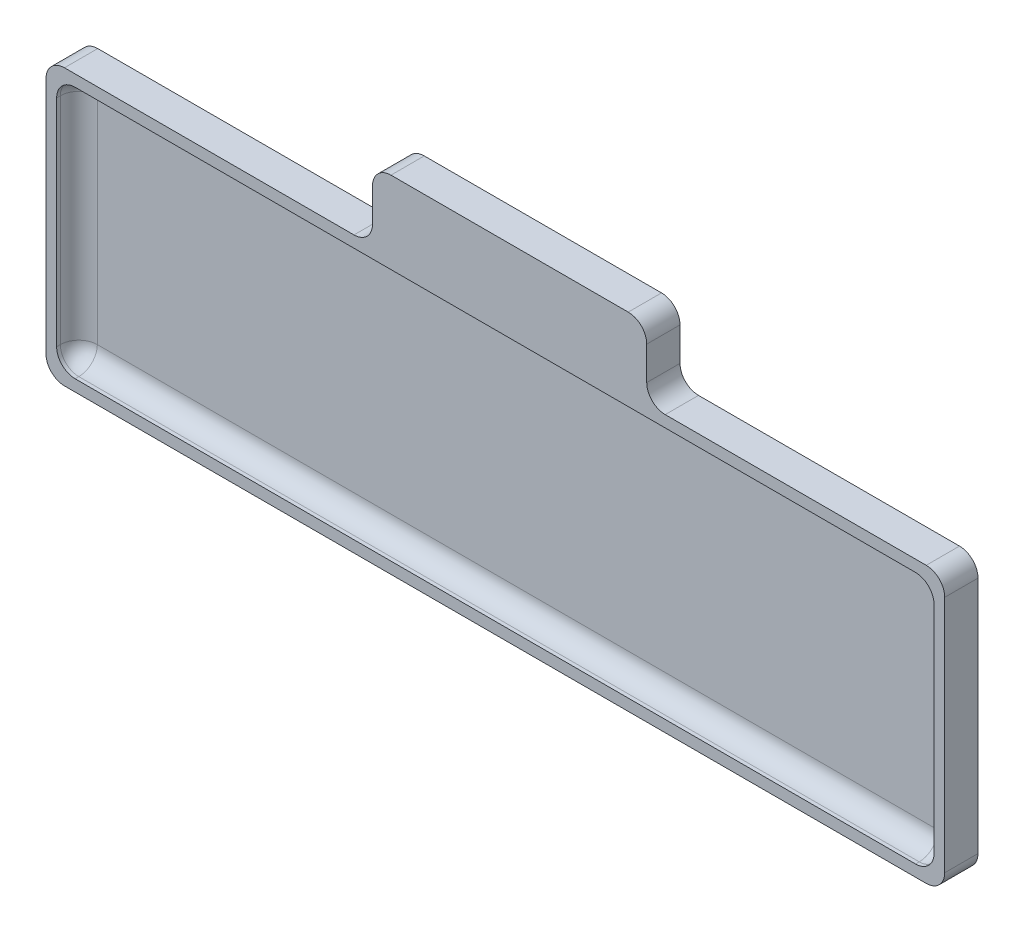
ISO-10303-21;
HEADER;
FILE_DESCRIPTION(('STEP AP214'),'2;1');
FILE_NAME('part.step','',(''),(''),'','','');
FILE_SCHEMA(('AUTOMOTIVE_DESIGN { 1 0 10303 214 1 1 1 1 }'));
ENDSEC;
DATA;
#1=APPLICATION_CONTEXT('core data for automotive mechanical design processes');
#2=APPLICATION_PROTOCOL_DEFINITION('international standard','automotive_design',2000,#1);
#3=PRODUCT_CONTEXT('',#1,'mechanical');
#4=PRODUCT('Part','Part','',(#3));
#5=PRODUCT_RELATED_PRODUCT_CATEGORY('part','',(#4));
#6=PRODUCT_DEFINITION_FORMATION('','',#4);
#7=PRODUCT_DEFINITION_CONTEXT('part definition',#1,'design');
#8=PRODUCT_DEFINITION('design','',#6,#7);
#9=PRODUCT_DEFINITION_SHAPE('','',#8);
#10=(LENGTH_UNIT() NAMED_UNIT(*) SI_UNIT(.MILLI.,.METRE.));
#11=(NAMED_UNIT(*) PLANE_ANGLE_UNIT() SI_UNIT($,.RADIAN.));
#12=(NAMED_UNIT(*) SI_UNIT($,.STERADIAN.) SOLID_ANGLE_UNIT());
#13=UNCERTAINTY_MEASURE_WITH_UNIT(LENGTH_MEASURE(1.E-05),#10,'distance_accuracy_value','');
#14=(GEOMETRIC_REPRESENTATION_CONTEXT(3) GLOBAL_UNCERTAINTY_ASSIGNED_CONTEXT((#13)) GLOBAL_UNIT_ASSIGNED_CONTEXT((#10,
#11,#12)) REPRESENTATION_CONTEXT('',''));
#15=CARTESIAN_POINT('',(0.,0.,0.));
#16=DIRECTION('',(0.,0.,1.));
#17=DIRECTION('',(1.,0.,0.));
#18=AXIS2_PLACEMENT_3D('',#15,#16,#17);
#19=CARTESIAN_POINT('',(0.,85.9423728813559,3.));
#20=DIRECTION('',(0.,1.,0.));
#21=DIRECTION('',(0.,0.,1.));
#22=AXIS2_PLACEMENT_3D('',#19,#20,#21);
#23=PLANE('',#22);
#24=DIRECTION('',(1.,0.,0.));
#25=VECTOR('',#24,1.);
#26=CARTESIAN_POINT('',(0.,85.9423728813559,9.));
#27=LINE('',#26,#25);
#28=CARTESIAN_POINT('',(-112.793220338983,85.9423728813559,9.));
#29=VERTEX_POINT('',#28);
#30=CARTESIAN_POINT('',(-34.5155586647697,85.9423728813559,9.));
#31=VERTEX_POINT('',#30);
#32=EDGE_CURVE('E412',#29,#31,#27,.T.);
#33=ORIENTED_EDGE('',*,*,#32,.T.);
#34=DIRECTION('',(0.,0.,1.));
#35=VECTOR('',#34,1.);
#36=CARTESIAN_POINT('',(-34.5155586647697,85.9423728813559,3.));
#37=LINE('',#36,#35);
#38=CARTESIAN_POINT('',(-34.5155586647697,85.9423728813559,0.));
#39=VERTEX_POINT('',#38);
#40=EDGE_CURVE('E300',#31,#39,#37,.F.);
#41=ORIENTED_EDGE('',*,*,#40,.T.);
#42=DIRECTION('',(1.,0.,0.));
#43=VECTOR('',#42,1.);
#44=CARTESIAN_POINT('',(0.,85.9423728813559,0.));
#45=LINE('',#44,#43);
#46=CARTESIAN_POINT('',(-112.793220338983,85.9423728813559,0.));
#47=VERTEX_POINT('',#46);
#48=EDGE_CURVE('E423',#47,#39,#45,.T.);
#49=ORIENTED_EDGE('',*,*,#48,.F.);
#50=DIRECTION('',(0.,0.,-1.));
#51=VECTOR('',#50,1.);
#52=CARTESIAN_POINT('',(-112.793220338983,85.9423728813559,9.));
#53=LINE('',#52,#51);
#54=EDGE_CURVE('E298',#47,#29,#53,.F.);
#55=ORIENTED_EDGE('',*,*,#54,.T.);
#56=EDGE_LOOP('',(#33,#41,#49,#55));
#57=FACE_BOUND('',#56,.T.);
#58=ADVANCED_FACE('F39',(#57),#23,.T.);
#59=CARTESIAN_POINT('',(125.206779661017,0.,3.));
#60=DIRECTION('',(1.,0.,0.));
#61=DIRECTION('',(0.,0.,-1.));
#62=AXIS2_PLACEMENT_3D('',#59,#60,#61);
#63=PLANE('',#62);
#64=DIRECTION('',(0.,-1.,0.));
#65=VECTOR('',#64,1.);
#66=CARTESIAN_POINT('',(125.206779661017,0.,0.));
#67=LINE('',#66,#65);
#68=CARTESIAN_POINT('',(125.206779661017,80.9423728813559,0.));
#69=VERTEX_POINT('',#68);
#70=CARTESIAN_POINT('',(125.206779661017,16.4423728813559,0.));
#71=VERTEX_POINT('',#70);
#72=EDGE_CURVE('E419',#69,#71,#67,.T.);
#73=ORIENTED_EDGE('',*,*,#72,.F.);
#74=DIRECTION('',(0.,0.,-1.));
#75=VECTOR('',#74,1.);
#76=CARTESIAN_POINT('',(125.206779661017,80.9423728813559,3.));
#77=LINE('',#76,#75);
#78=CARTESIAN_POINT('',(125.206779661017,80.9423728813559,9.));
#79=VERTEX_POINT('',#78);
#80=EDGE_CURVE('E333',#69,#79,#77,.F.);
#81=ORIENTED_EDGE('',*,*,#80,.T.);
#82=DIRECTION('',(0.,-1.,0.));
#83=VECTOR('',#82,1.);
#84=CARTESIAN_POINT('',(125.206779661017,0.,9.));
#85=LINE('',#84,#83);
#86=CARTESIAN_POINT('',(125.206779661017,16.4423728813559,9.));
#87=VERTEX_POINT('',#86);
#88=EDGE_CURVE('E442',#79,#87,#85,.T.);
#89=ORIENTED_EDGE('',*,*,#88,.T.);
#90=DIRECTION('',(0.,0.,-1.));
#91=VECTOR('',#90,1.);
#92=CARTESIAN_POINT('',(125.206779661017,16.4423728813559,0.));
#93=LINE('',#92,#91);
#94=EDGE_CURVE('E330',#87,#71,#93,.T.);
#95=ORIENTED_EDGE('',*,*,#94,.T.);
#96=EDGE_LOOP('',(#73,#81,#89,#95));
#97=FACE_BOUND('',#96,.T.);
#98=ADVANCED_FACE('F473',(#97),#63,.T.);
#99=CARTESIAN_POINT('',(49.6346793475373,85.9423728813559,0.));
#100=VERTEX_POINT('',#99);
#101=CARTESIAN_POINT('',(120.206779661017,85.9423728813559,0.));
#102=VERTEX_POINT('',#101);
#103=EDGE_CURVE('E422',#100,#102,#45,.T.);
#104=ORIENTED_EDGE('',*,*,#103,.F.);
#105=DIRECTION('',(0.,0.,-1.));
#106=VECTOR('',#105,1.);
#107=CARTESIAN_POINT('',(49.6346793475373,85.9423728813559,3.));
#108=LINE('',#107,#106);
#109=CARTESIAN_POINT('',(49.6346793475373,85.9423728813559,9.));
#110=VERTEX_POINT('',#109);
#111=EDGE_CURVE('E291',#100,#110,#108,.F.);
#112=ORIENTED_EDGE('',*,*,#111,.T.);
#113=CARTESIAN_POINT('',(120.206779661017,85.9423728813559,9.));
#114=VERTEX_POINT('',#113);
#115=EDGE_CURVE('E446',#110,#114,#27,.T.);
#116=ORIENTED_EDGE('',*,*,#115,.T.);
#117=DIRECTION('',(0.,0.,-1.));
#118=VECTOR('',#117,1.);
#119=CARTESIAN_POINT('',(120.206779661017,85.9423728813559,3.));
#120=LINE('',#119,#118);
#121=EDGE_CURVE('E288',#114,#102,#120,.T.);
#122=ORIENTED_EDGE('',*,*,#121,.T.);
#123=EDGE_LOOP('',(#104,#112,#116,#122));
#124=FACE_BOUND('',#123,.T.);
#125=ADVANCED_FACE('F461',(#124),#23,.T.);
#126=CARTESIAN_POINT('',(-117.793220338983,0.,3.));
#127=DIRECTION('',(1.,0.,0.));
#128=DIRECTION('',(0.,1.,0.));
#129=AXIS2_PLACEMENT_3D('',#126,#127,#128);
#130=PLANE('',#129);
#131=DIRECTION('',(0.,-1.,0.));
#132=VECTOR('',#131,1.);
#133=CARTESIAN_POINT('',(-117.793220338983,0.,0.));
#134=LINE('',#133,#132);
#135=CARTESIAN_POINT('',(-117.793220338983,80.9423728813559,0.));
#136=VERTEX_POINT('',#135);
#137=CARTESIAN_POINT('',(-117.793220338983,16.4423728813559,0.));
#138=VERTEX_POINT('',#137);
#139=EDGE_CURVE('E252',#136,#138,#134,.T.);
#140=ORIENTED_EDGE('',*,*,#139,.T.);
#141=DIRECTION('',(0.,0.,-1.));
#142=VECTOR('',#141,1.);
#143=CARTESIAN_POINT('',(-117.793220338983,16.4423728813559,3.));
#144=LINE('',#143,#142);
#145=CARTESIAN_POINT('',(-117.793220338983,16.4423728813559,9.));
#146=VERTEX_POINT('',#145);
#147=EDGE_CURVE('E342',#138,#146,#144,.F.);
#148=ORIENTED_EDGE('',*,*,#147,.T.);
#149=DIRECTION('',(0.,-1.,0.));
#150=VECTOR('',#149,1.);
#151=CARTESIAN_POINT('',(-117.793220338983,0.,9.));
#152=LINE('',#151,#150);
#153=CARTESIAN_POINT('',(-117.793220338983,80.9423728813559,9.));
#154=VERTEX_POINT('',#153);
#155=EDGE_CURVE('E406',#154,#146,#152,.T.);
#156=ORIENTED_EDGE('',*,*,#155,.F.);
#157=DIRECTION('',(0.,0.,-1.));
#158=VECTOR('',#157,1.);
#159=CARTESIAN_POINT('',(-117.793220338983,80.9423728813559,0.));
#160=LINE('',#159,#158);
#161=EDGE_CURVE('E340',#154,#136,#160,.T.);
#162=ORIENTED_EDGE('',*,*,#161,.T.);
#163=EDGE_LOOP('',(#140,#148,#156,#162));
#164=FACE_BOUND('',#163,.T.);
#165=ADVANCED_FACE('F427',(#164),#130,.F.);
#166=CARTESIAN_POINT('',(0.,11.4423728813559,3.));
#167=DIRECTION('',(0.,1.,0.));
#168=DIRECTION('',(0.,0.,1.));
#169=AXIS2_PLACEMENT_3D('',#166,#167,#168);
#170=PLANE('',#169);
#171=DIRECTION('',(1.,0.,0.));
#172=VECTOR('',#171,1.);
#173=CARTESIAN_POINT('',(0.,11.4423728813559,0.));
#174=LINE('',#173,#172);
#175=CARTESIAN_POINT('',(-112.793220338983,11.4423728813559,0.));
#176=VERTEX_POINT('',#175);
#177=CARTESIAN_POINT('',(120.206779661017,11.4423728813559,0.));
#178=VERTEX_POINT('',#177);
#179=EDGE_CURVE('E249',#176,#178,#174,.T.);
#180=ORIENTED_EDGE('',*,*,#179,.T.);
#181=DIRECTION('',(0.,0.,-1.));
#182=VECTOR('',#181,1.);
#183=CARTESIAN_POINT('',(120.206779661017,11.4423728813559,9.));
#184=LINE('',#183,#182);
#185=CARTESIAN_POINT('',(120.206779661017,11.4423728813559,9.));
#186=VERTEX_POINT('',#185);
#187=EDGE_CURVE('E338',#178,#186,#184,.F.);
#188=ORIENTED_EDGE('',*,*,#187,.T.);
#189=DIRECTION('',(1.,0.,0.));
#190=VECTOR('',#189,1.);
#191=CARTESIAN_POINT('',(0.,11.4423728813559,9.));
#192=LINE('',#191,#190);
#193=CARTESIAN_POINT('',(-112.793220338983,11.4423728813559,9.));
#194=VERTEX_POINT('',#193);
#195=EDGE_CURVE('E437',#194,#186,#192,.T.);
#196=ORIENTED_EDGE('',*,*,#195,.F.);
#197=DIRECTION('',(0.,0.,-1.));
#198=VECTOR('',#197,1.);
#199=CARTESIAN_POINT('',(-112.793220338983,11.4423728813559,3.));
#200=LINE('',#199,#198);
#201=EDGE_CURVE('E335',#194,#176,#200,.T.);
#202=ORIENTED_EDGE('',*,*,#201,.T.);
#203=EDGE_LOOP('',(#180,#188,#196,#202));
#204=FACE_BOUND('',#203,.T.);
#205=ADVANCED_FACE('F440',(#204),#170,.F.);
#206=CARTESIAN_POINT('',(0.,0.,0.));
#207=DIRECTION('',(0.,0.,1.));
#208=DIRECTION('',(1.,0.,0.));
#209=AXIS2_PLACEMENT_3D('',#206,#207,#208);
#210=PLANE('',#209);
#211=DIRECTION('',(0.,-1.,0.));
#212=VECTOR('',#211,1.);
#213=CARTESIAN_POINT('',(-29.5155586647697,104.942372881356,0.));
#214=LINE('',#213,#212);
#215=CARTESIAN_POINT('',(-29.5155586647697,99.9423728813559,0.));
#216=VERTEX_POINT('',#215);
#217=CARTESIAN_POINT('',(-29.5155586647697,90.9423728813559,0.));
#218=VERTEX_POINT('',#217);
#219=EDGE_CURVE('E543',#216,#218,#214,.T.);
#220=ORIENTED_EDGE('',*,*,#219,.F.);
#221=CARTESIAN_POINT('',(-24.5155586647697,99.9423728813559,0.));
#222=DIRECTION('',(0.,0.,1.));
#223=DIRECTION('',(1.,0.,0.));
#224=AXIS2_PLACEMENT_3D('',#221,#222,#223);
#225=CIRCLE('',#224,5.);
#226=CARTESIAN_POINT('',(-24.5155586647697,104.942372881356,0.));
#227=VERTEX_POINT('',#226);
#228=EDGE_CURVE('E328',#216,#227,#225,.F.);
#229=ORIENTED_EDGE('',*,*,#228,.T.);
#230=DIRECTION('',(-1.,0.,0.));
#231=VECTOR('',#230,1.);
#232=CARTESIAN_POINT('',(-29.5155586647697,104.942372881356,0.));
#233=LINE('',#232,#231);
#234=CARTESIAN_POINT('',(39.6346793475373,104.942372881356,0.));
#235=VERTEX_POINT('',#234);
#236=EDGE_CURVE('E539',#235,#227,#233,.T.);
#237=ORIENTED_EDGE('',*,*,#236,.F.);
#238=CARTESIAN_POINT('',(39.6346793475373,99.9423728813559,0.));
#239=DIRECTION('',(0.,0.,1.));
#240=DIRECTION('',(1.,0.,0.));
#241=AXIS2_PLACEMENT_3D('',#238,#239,#240);
#242=CIRCLE('',#241,5.);
#243=CARTESIAN_POINT('',(44.6346793475373,99.9423728813559,0.));
#244=VERTEX_POINT('',#243);
#245=EDGE_CURVE('E326',#235,#244,#242,.F.);
#246=ORIENTED_EDGE('',*,*,#245,.T.);
#247=DIRECTION('',(0.,-1.,0.));
#248=VECTOR('',#247,1.);
#249=CARTESIAN_POINT('',(44.6346793475373,104.942372881356,0.));
#250=LINE('',#249,#248);
#251=CARTESIAN_POINT('',(44.6346793475373,90.9423728813559,0.));
#252=VERTEX_POINT('',#251);
#253=EDGE_CURVE('E558',#244,#252,#250,.T.);
#254=ORIENTED_EDGE('',*,*,#253,.T.);
#255=CARTESIAN_POINT('',(49.6346793475373,90.9423728813559,0.));
#256=DIRECTION('',(0.,0.,1.));
#257=DIRECTION('',(1.,0.,0.));
#258=AXIS2_PLACEMENT_3D('',#255,#256,#257);
#259=CIRCLE('',#258,5.);
#260=EDGE_CURVE('E344',#252,#100,#259,.T.);
#261=ORIENTED_EDGE('',*,*,#260,.T.);
#262=ORIENTED_EDGE('',*,*,#103,.T.);
#263=CARTESIAN_POINT('',(120.206779661017,80.9423728813559,0.));
#264=DIRECTION('',(0.,0.,1.));
#265=DIRECTION('',(1.,0.,0.));
#266=AXIS2_PLACEMENT_3D('',#263,#264,#265);
#267=CIRCLE('',#266,5.);
#268=EDGE_CURVE('E324',#102,#69,#267,.F.);
#269=ORIENTED_EDGE('',*,*,#268,.T.);
#270=ORIENTED_EDGE('',*,*,#72,.T.);
#271=CARTESIAN_POINT('',(120.206779661017,16.4423728813559,0.));
#272=DIRECTION('',(0.,0.,1.));
#273=DIRECTION('',(1.,0.,0.));
#274=AXIS2_PLACEMENT_3D('',#271,#272,#273);
#275=CIRCLE('',#274,5.);
#276=EDGE_CURVE('E322',#71,#178,#275,.F.);
#277=ORIENTED_EDGE('',*,*,#276,.T.);
#278=ORIENTED_EDGE('',*,*,#179,.F.);
#279=CARTESIAN_POINT('',(-112.793220338983,16.4423728813559,0.));
#280=DIRECTION('',(0.,0.,1.));
#281=DIRECTION('',(1.,0.,0.));
#282=AXIS2_PLACEMENT_3D('',#279,#280,#281);
#283=CIRCLE('',#282,5.);
#284=EDGE_CURVE('E56',#176,#138,#283,.F.);
#285=ORIENTED_EDGE('',*,*,#284,.T.);
#286=ORIENTED_EDGE('',*,*,#139,.F.);
#287=CARTESIAN_POINT('',(-112.793220338983,80.9423728813559,0.));
#288=DIRECTION('',(0.,0.,1.));
#289=DIRECTION('',(1.,0.,0.));
#290=AXIS2_PLACEMENT_3D('',#287,#288,#289);
#291=CIRCLE('',#290,5.);
#292=EDGE_CURVE('E64',#136,#47,#291,.F.);
#293=ORIENTED_EDGE('',*,*,#292,.T.);
#294=ORIENTED_EDGE('',*,*,#48,.T.);
#295=CARTESIAN_POINT('',(-34.5155586647697,90.9423728813559,0.));
#296=DIRECTION('',(0.,0.,1.));
#297=DIRECTION('',(1.,0.,0.));
#298=AXIS2_PLACEMENT_3D('',#295,#296,#297);
#299=CIRCLE('',#298,5.);
#300=EDGE_CURVE('E350',#39,#218,#299,.T.);
#301=ORIENTED_EDGE('',*,*,#300,.T.);
#302=EDGE_LOOP('',(#220,#229,#237,#246,#254,#261,#262,#269,#270,#277,#278,#285,#286,#293,#294,#301));
#303=FACE_BOUND('',#302,.T.);
#304=ADVANCED_FACE('F471',(#303),#210,.F.);
#305=CARTESIAN_POINT('',(0.,82.8248656602381,9.));
#306=DIRECTION('',(0.,1.,0.));
#307=DIRECTION('',(0.,0.,1.));
#308=AXIS2_PLACEMENT_3D('',#305,#306,#307);
#309=PLANE('',#308);
#310=DIRECTION('',(-1.,0.,0.));
#311=VECTOR('',#310,1.);
#312=CARTESIAN_POINT('',(0.,82.8248656602381,8.));
#313=LINE('',#312,#311);
#314=CARTESIAN_POINT('',(-109.915521365644,82.8248656602381,8.));
#315=VERTEX_POINT('',#314);
#316=CARTESIAN_POINT('',(117.329080687677,82.8248656602381,8.));
#317=VERTEX_POINT('',#316);
#318=EDGE_CURVE('E261',#315,#317,#313,.F.);
#319=ORIENTED_EDGE('',*,*,#318,.T.);
#320=DIRECTION('',(0.,0.,-1.));
#321=VECTOR('',#320,1.);
#322=CARTESIAN_POINT('',(117.329080687677,82.8248656602381,9.));
#323=LINE('',#322,#321);
#324=CARTESIAN_POINT('',(117.329080687677,82.8248656602381,9.));
#325=VERTEX_POINT('',#324);
#326=EDGE_CURVE('E264',#317,#325,#323,.F.);
#327=ORIENTED_EDGE('',*,*,#326,.T.);
#328=DIRECTION('',(1.,0.,0.));
#329=VECTOR('',#328,1.);
#330=CARTESIAN_POINT('',(0.,82.8248656602381,9.));
#331=LINE('',#330,#329);
#332=CARTESIAN_POINT('',(-109.915521365644,82.8248656602381,9.));
#333=VERTEX_POINT('',#332);
#334=EDGE_CURVE('E399',#333,#325,#331,.T.);
#335=ORIENTED_EDGE('',*,*,#334,.F.);
#336=DIRECTION('',(0.,0.,-1.));
#337=VECTOR('',#336,1.);
#338=CARTESIAN_POINT('',(-109.915521365644,82.8248656602381,9.));
#339=LINE('',#338,#337);
#340=EDGE_CURVE('E259',#333,#315,#339,.T.);
#341=ORIENTED_EDGE('',*,*,#340,.T.);
#342=EDGE_LOOP('',(#319,#327,#335,#341));
#343=FACE_BOUND('',#342,.T.);
#344=ADVANCED_FACE('F403',(#343),#309,.F.);
#345=CARTESIAN_POINT('',(122.329080687677,0.,9.));
#346=DIRECTION('',(1.,0.,0.));
#347=DIRECTION('',(0.,1.,0.));
#348=AXIS2_PLACEMENT_3D('',#345,#346,#347);
#349=PLANE('',#348);
#350=DIRECTION('',(0.,-1.,0.));
#351=VECTOR('',#350,1.);
#352=CARTESIAN_POINT('',(122.329080687677,0.,9.));
#353=LINE('',#352,#351);
#354=CARTESIAN_POINT('',(122.329080687677,77.8248656602381,9.));
#355=VERTEX_POINT('',#354);
#356=CARTESIAN_POINT('',(122.329080687677,19.5598801024738,9.));
#357=VERTEX_POINT('',#356);
#358=EDGE_CURVE('E405',#355,#357,#353,.T.);
#359=ORIENTED_EDGE('',*,*,#358,.F.);
#360=DIRECTION('',(0.,0.,-1.));
#361=VECTOR('',#360,1.);
#362=CARTESIAN_POINT('',(122.329080687677,77.8248656602381,3.));
#363=LINE('',#362,#361);
#364=CARTESIAN_POINT('',(122.329080687677,77.8248656602381,8.));
#365=VERTEX_POINT('',#364);
#366=EDGE_CURVE('E281',#355,#365,#363,.T.);
#367=ORIENTED_EDGE('',*,*,#366,.T.);
#368=DIRECTION('',(0.,1.,0.));
#369=VECTOR('',#368,1.);
#370=CARTESIAN_POINT('',(122.329080687677,0.,8.));
#371=LINE('',#370,#369);
#372=CARTESIAN_POINT('',(122.329080687677,19.5598801024738,8.));
#373=VERTEX_POINT('',#372);
#374=EDGE_CURVE('E279',#365,#373,#371,.F.);
#375=ORIENTED_EDGE('',*,*,#374,.T.);
#376=DIRECTION('',(0.,0.,-1.));
#377=VECTOR('',#376,1.);
#378=CARTESIAN_POINT('',(122.329080687677,19.5598801024738,9.));
#379=LINE('',#378,#377);
#380=EDGE_CURVE('E277',#373,#357,#379,.F.);
#381=ORIENTED_EDGE('',*,*,#380,.T.);
#382=EDGE_LOOP('',(#359,#367,#375,#381));
#383=FACE_BOUND('',#382,.T.);
#384=ADVANCED_FACE('F509',(#383),#349,.F.);
#385=CARTESIAN_POINT('',(0.,14.5598801024738,9.));
#386=DIRECTION('',(0.,1.,0.));
#387=DIRECTION('',(-1.,0.,0.));
#388=AXIS2_PLACEMENT_3D('',#385,#386,#387);
#389=PLANE('',#388);
#390=DIRECTION('',(1.,0.,0.));
#391=VECTOR('',#390,1.);
#392=CARTESIAN_POINT('',(0.,14.5598801024738,9.));
#393=LINE('',#392,#391);
#394=CARTESIAN_POINT('',(-109.915521365644,14.5598801024738,9.));
#395=VERTEX_POINT('',#394);
#396=CARTESIAN_POINT('',(117.329080687677,14.5598801024738,9.));
#397=VERTEX_POINT('',#396);
#398=EDGE_CURVE('E409',#395,#397,#393,.T.);
#399=ORIENTED_EDGE('',*,*,#398,.T.);
#400=DIRECTION('',(0.,0.,-1.));
#401=VECTOR('',#400,1.);
#402=CARTESIAN_POINT('',(117.329080687677,14.5598801024738,9.));
#403=LINE('',#402,#401);
#404=CARTESIAN_POINT('',(117.329080687677,14.5598801024738,8.));
#405=VERTEX_POINT('',#404);
#406=EDGE_CURVE('E275',#397,#405,#403,.T.);
#407=ORIENTED_EDGE('',*,*,#406,.T.);
#408=DIRECTION('',(-1.,0.,0.));
#409=VECTOR('',#408,1.);
#410=CARTESIAN_POINT('',(-114.915521365644,14.5598801024738,8.));
#411=LINE('',#410,#409);
#412=CARTESIAN_POINT('',(-109.915521365644,14.5598801024738,8.));
#413=VERTEX_POINT('',#412);
#414=EDGE_CURVE('E232',#405,#413,#411,.T.);
#415=ORIENTED_EDGE('',*,*,#414,.T.);
#416=DIRECTION('',(0.,0.,-1.));
#417=VECTOR('',#416,1.);
#418=CARTESIAN_POINT('',(-109.915521365644,14.5598801024738,9.));
#419=LINE('',#418,#417);
#420=EDGE_CURVE('E272',#413,#395,#419,.F.);
#421=ORIENTED_EDGE('',*,*,#420,.T.);
#422=EDGE_LOOP('',(#399,#407,#415,#421));
#423=FACE_BOUND('',#422,.T.);
#424=ADVANCED_FACE('F512',(#423),#389,.T.);
#425=CARTESIAN_POINT('',(-114.915521365644,0.,9.));
#426=DIRECTION('',(1.,0.,0.));
#427=DIRECTION('',(0.,1.,0.));
#428=AXIS2_PLACEMENT_3D('',#425,#426,#427);
#429=PLANE('',#428);
#430=DIRECTION('',(0.,-1.,0.));
#431=VECTOR('',#430,1.);
#432=CARTESIAN_POINT('',(-114.915521365644,0.,9.));
#433=LINE('',#432,#431);
#434=CARTESIAN_POINT('',(-114.915521365644,77.8248656602381,9.));
#435=VERTEX_POINT('',#434);
#436=CARTESIAN_POINT('',(-114.915521365644,19.5598801024738,9.));
#437=VERTEX_POINT('',#436);
#438=EDGE_CURVE('E401',#435,#437,#433,.T.);
#439=ORIENTED_EDGE('',*,*,#438,.T.);
#440=DIRECTION('',(0.,0.,-1.));
#441=VECTOR('',#440,1.);
#442=CARTESIAN_POINT('',(-114.915521365644,19.5598801024738,3.));
#443=LINE('',#442,#441);
#444=CARTESIAN_POINT('',(-114.915521365644,19.5598801024738,8.));
#445=VERTEX_POINT('',#444);
#446=EDGE_CURVE('E270',#437,#445,#443,.T.);
#447=ORIENTED_EDGE('',*,*,#446,.T.);
#448=DIRECTION('',(0.,1.,0.));
#449=VECTOR('',#448,1.);
#450=CARTESIAN_POINT('',(-114.915521365644,82.8248656602381,8.));
#451=LINE('',#450,#449);
#452=CARTESIAN_POINT('',(-114.915521365644,77.8248656602381,8.));
#453=VERTEX_POINT('',#452);
#454=EDGE_CURVE('E268',#445,#453,#451,.T.);
#455=ORIENTED_EDGE('',*,*,#454,.T.);
#456=DIRECTION('',(0.,0.,-1.));
#457=VECTOR('',#456,1.);
#458=CARTESIAN_POINT('',(-114.915521365644,77.8248656602381,9.));
#459=LINE('',#458,#457);
#460=EDGE_CURVE('E266',#453,#435,#459,.F.);
#461=ORIENTED_EDGE('',*,*,#460,.T.);
#462=EDGE_LOOP('',(#439,#447,#455,#461));
#463=FACE_BOUND('',#462,.T.);
#464=ADVANCED_FACE('F386',(#463),#429,.T.);
#465=CARTESIAN_POINT('',(0.,0.,9.));
#466=DIRECTION('',(0.,0.,1.));
#467=DIRECTION('',(1.,0.,0.));
#468=AXIS2_PLACEMENT_3D('',#465,#466,#467);
#469=PLANE('',#468);
#470=DIRECTION('',(1.,0.,0.));
#471=VECTOR('',#470,1.);
#472=CARTESIAN_POINT('',(-29.5155586647697,104.942372881356,9.));
#473=LINE('',#472,#471);
#474=CARTESIAN_POINT('',(-24.5155586647697,104.942372881356,9.));
#475=VERTEX_POINT('',#474);
#476=CARTESIAN_POINT('',(39.6346793475373,104.942372881356,9.));
#477=VERTEX_POINT('',#476);
#478=EDGE_CURVE('E544',#475,#477,#473,.T.);
#479=ORIENTED_EDGE('',*,*,#478,.F.);
#480=CARTESIAN_POINT('',(-24.5155586647697,99.9423728813559,9.));
#481=DIRECTION('',(0.,0.,1.));
#482=DIRECTION('',(1.,0.,0.));
#483=AXIS2_PLACEMENT_3D('',#480,#481,#482);
#484=CIRCLE('',#483,5.);
#485=CARTESIAN_POINT('',(-29.5155586647697,99.9423728813559,9.));
#486=VERTEX_POINT('',#485);
#487=EDGE_CURVE('E318',#475,#486,#484,.T.);
#488=ORIENTED_EDGE('',*,*,#487,.T.);
#489=DIRECTION('',(0.,-1.,0.));
#490=VECTOR('',#489,1.);
#491=CARTESIAN_POINT('',(-29.5155586647697,104.942372881356,9.));
#492=LINE('',#491,#490);
#493=CARTESIAN_POINT('',(-29.5155586647697,90.9423728813559,9.));
#494=VERTEX_POINT('',#493);
#495=EDGE_CURVE('E443',#486,#494,#492,.T.);
#496=ORIENTED_EDGE('',*,*,#495,.T.);
#497=CARTESIAN_POINT('',(-34.5155586647697,90.9423728813559,9.));
#498=DIRECTION('',(0.,0.,1.));
#499=DIRECTION('',(1.,0.,0.));
#500=AXIS2_PLACEMENT_3D('',#497,#498,#499);
#501=CIRCLE('',#500,5.);
#502=EDGE_CURVE('E348',#494,#31,#501,.F.);
#503=ORIENTED_EDGE('',*,*,#502,.T.);
#504=ORIENTED_EDGE('',*,*,#32,.F.);
#505=CARTESIAN_POINT('',(-112.793220338983,80.9423728813559,9.));
#506=DIRECTION('',(0.,0.,1.));
#507=DIRECTION('',(1.,0.,0.));
#508=AXIS2_PLACEMENT_3D('',#505,#506,#507);
#509=CIRCLE('',#508,5.);
#510=EDGE_CURVE('E308',#29,#154,#509,.T.);
#511=ORIENTED_EDGE('',*,*,#510,.T.);
#512=ORIENTED_EDGE('',*,*,#155,.T.);
#513=CARTESIAN_POINT('',(-112.793220338983,16.4423728813559,9.));
#514=DIRECTION('',(0.,0.,1.));
#515=DIRECTION('',(1.,0.,0.));
#516=AXIS2_PLACEMENT_3D('',#513,#514,#515);
#517=CIRCLE('',#516,5.);
#518=EDGE_CURVE('E310',#146,#194,#517,.T.);
#519=ORIENTED_EDGE('',*,*,#518,.T.);
#520=ORIENTED_EDGE('',*,*,#195,.T.);
#521=CARTESIAN_POINT('',(120.206779661017,16.4423728813559,9.));
#522=DIRECTION('',(0.,0.,1.));
#523=DIRECTION('',(1.,0.,0.));
#524=AXIS2_PLACEMENT_3D('',#521,#522,#523);
#525=CIRCLE('',#524,5.);
#526=EDGE_CURVE('E312',#186,#87,#525,.T.);
#527=ORIENTED_EDGE('',*,*,#526,.T.);
#528=ORIENTED_EDGE('',*,*,#88,.F.);
#529=CARTESIAN_POINT('',(120.206779661017,80.9423728813559,9.));
#530=DIRECTION('',(0.,0.,1.));
#531=DIRECTION('',(1.,0.,0.));
#532=AXIS2_PLACEMENT_3D('',#529,#530,#531);
#533=CIRCLE('',#532,5.);
#534=EDGE_CURVE('E314',#79,#114,#533,.T.);
#535=ORIENTED_EDGE('',*,*,#534,.T.);
#536=ORIENTED_EDGE('',*,*,#115,.F.);
#537=CARTESIAN_POINT('',(49.6346793475373,90.9423728813559,9.));
#538=DIRECTION('',(0.,0.,1.));
#539=DIRECTION('',(1.,0.,0.));
#540=AXIS2_PLACEMENT_3D('',#537,#538,#539);
#541=CIRCLE('',#540,5.);
#542=CARTESIAN_POINT('',(44.6346793475373,90.9423728813559,9.));
#543=VERTEX_POINT('',#542);
#544=EDGE_CURVE('E346',#110,#543,#541,.F.);
#545=ORIENTED_EDGE('',*,*,#544,.T.);
#546=DIRECTION('',(0.,-1.,0.));
#547=VECTOR('',#546,1.);
#548=CARTESIAN_POINT('',(44.6346793475373,104.942372881356,9.));
#549=LINE('',#548,#547);
#550=CARTESIAN_POINT('',(44.6346793475373,99.9423728813559,9.));
#551=VERTEX_POINT('',#550);
#552=EDGE_CURVE('E449',#551,#543,#549,.T.);
#553=ORIENTED_EDGE('',*,*,#552,.F.);
#554=CARTESIAN_POINT('',(39.6346793475373,99.9423728813559,9.));
#555=DIRECTION('',(0.,0.,1.));
#556=DIRECTION('',(1.,0.,0.));
#557=AXIS2_PLACEMENT_3D('',#554,#555,#556);
#558=CIRCLE('',#557,5.);
#559=EDGE_CURVE('E316',#551,#477,#558,.T.);
#560=ORIENTED_EDGE('',*,*,#559,.T.);
#561=EDGE_LOOP('',(#479,#488,#496,#503,#504,#511,#512,#519,#520,#527,#528,#535,#536,#545,#553,#560));
#562=FACE_BOUND('',#561,.T.);
#563=ORIENTED_EDGE('',*,*,#438,.F.);
#564=CARTESIAN_POINT('',(-109.915521365644,77.8248656602381,9.));
#565=DIRECTION('',(0.,0.,1.));
#566=DIRECTION('',(1.,0.,0.));
#567=AXIS2_PLACEMENT_3D('',#564,#565,#566);
#568=CIRCLE('',#567,5.);
#569=EDGE_CURVE('E11',#435,#333,#568,.F.);
#570=ORIENTED_EDGE('',*,*,#569,.T.);
#571=ORIENTED_EDGE('',*,*,#334,.T.);
#572=CARTESIAN_POINT('',(117.329080687677,77.8248656602381,9.));
#573=DIRECTION('',(0.,0.,1.));
#574=DIRECTION('',(1.,0.,0.));
#575=AXIS2_PLACEMENT_3D('',#572,#573,#574);
#576=CIRCLE('',#575,5.);
#577=EDGE_CURVE('E352',#325,#355,#576,.F.);
#578=ORIENTED_EDGE('',*,*,#577,.T.);
#579=ORIENTED_EDGE('',*,*,#358,.T.);
#580=CARTESIAN_POINT('',(117.329080687677,19.5598801024738,9.));
#581=DIRECTION('',(0.,0.,1.));
#582=DIRECTION('',(1.,0.,0.));
#583=AXIS2_PLACEMENT_3D('',#580,#581,#582);
#584=CIRCLE('',#583,5.);
#585=EDGE_CURVE('E354',#357,#397,#584,.F.);
#586=ORIENTED_EDGE('',*,*,#585,.T.);
#587=ORIENTED_EDGE('',*,*,#398,.F.);
#588=CARTESIAN_POINT('',(-109.915521365644,19.5598801024738,9.));
#589=DIRECTION('',(0.,0.,1.));
#590=DIRECTION('',(1.,0.,0.));
#591=AXIS2_PLACEMENT_3D('',#588,#589,#590);
#592=CIRCLE('',#591,5.);
#593=EDGE_CURVE('E48',#395,#437,#592,.F.);
#594=ORIENTED_EDGE('',*,*,#593,.T.);
#595=EDGE_LOOP('',(#563,#570,#571,#578,#579,#586,#587,#594));
#596=FACE_BOUND('',#595,.T.);
#597=ADVANCED_FACE('F398',(#562,#596),#469,.T.);
#598=CARTESIAN_POINT('',(0.,0.,3.));
#599=DIRECTION('',(0.,0.,1.));
#600=DIRECTION('',(1.,0.,0.));
#601=AXIS2_PLACEMENT_3D('',#598,#599,#600);
#602=PLANE('',#601);
#603=DIRECTION('',(0.,1.,0.));
#604=VECTOR('',#603,1.);
#605=CARTESIAN_POINT('',(117.329080687677,0.,3.));
#606=LINE('',#605,#604);
#607=CARTESIAN_POINT('',(117.329080687677,19.5598801024738,3.));
#608=VERTEX_POINT('',#607);
#609=CARTESIAN_POINT('',(117.329080687677,77.8248656602381,3.));
#610=VERTEX_POINT('',#609);
#611=EDGE_CURVE('E219',#608,#610,#606,.T.);
#612=ORIENTED_EDGE('',*,*,#611,.T.);
#613=DIRECTION('',(-1.,0.,0.));
#614=VECTOR('',#613,1.);
#615=CARTESIAN_POINT('',(0.,77.8248656602381,3.));
#616=LINE('',#615,#614);
#617=CARTESIAN_POINT('',(-109.915521365644,77.8248656602381,3.));
#618=VERTEX_POINT('',#617);
#619=EDGE_CURVE('E257',#610,#618,#616,.T.);
#620=ORIENTED_EDGE('',*,*,#619,.T.);
#621=DIRECTION('',(0.,1.,0.));
#622=VECTOR('',#621,1.);
#623=CARTESIAN_POINT('',(-109.915521365644,14.5598801024738,3.));
#624=LINE('',#623,#622);
#625=CARTESIAN_POINT('',(-109.915521365644,19.5598801024738,3.));
#626=VERTEX_POINT('',#625);
#627=EDGE_CURVE('E222',#618,#626,#624,.F.);
#628=ORIENTED_EDGE('',*,*,#627,.T.);
#629=DIRECTION('',(-1.,0.,0.));
#630=VECTOR('',#629,1.);
#631=CARTESIAN_POINT('',(122.329080687677,19.5598801024738,3.));
#632=LINE('',#631,#630);
#633=EDGE_CURVE('E214',#626,#608,#632,.F.);
#634=ORIENTED_EDGE('',*,*,#633,.T.);
#635=EDGE_LOOP('',(#612,#620,#628,#634));
#636=FACE_BOUND('',#635,.T.);
#637=ADVANCED_FACE('F216',(#636),#602,.T.);
#638=CARTESIAN_POINT('',(-29.5155586647697,104.942372881356,0.));
#639=DIRECTION('',(1.,0.,0.));
#640=DIRECTION('',(0.,0.,-1.));
#641=AXIS2_PLACEMENT_3D('',#638,#639,#640);
#642=PLANE('',#641);
#643=ORIENTED_EDGE('',*,*,#219,.T.);
#644=DIRECTION('',(0.,0.,1.));
#645=VECTOR('',#644,1.);
#646=CARTESIAN_POINT('',(-29.5155586647697,90.9423728813559,0.));
#647=LINE('',#646,#645);
#648=EDGE_CURVE('E295',#218,#494,#647,.T.);
#649=ORIENTED_EDGE('',*,*,#648,.T.);
#650=ORIENTED_EDGE('',*,*,#495,.F.);
#651=DIRECTION('',(0.,0.,1.));
#652=VECTOR('',#651,1.);
#653=CARTESIAN_POINT('',(-29.5155586647697,99.9423728813559,0.));
#654=LINE('',#653,#652);
#655=EDGE_CURVE('E293',#486,#216,#654,.F.);
#656=ORIENTED_EDGE('',*,*,#655,.T.);
#657=EDGE_LOOP('',(#643,#649,#650,#656));
#658=FACE_BOUND('',#657,.T.);
#659=ADVANCED_FACE('F506',(#658),#642,.F.);
#660=CARTESIAN_POINT('',(44.6346793475373,104.942372881356,0.));
#661=DIRECTION('',(-1.,0.,0.));
#662=DIRECTION('',(0.,0.,1.));
#663=AXIS2_PLACEMENT_3D('',#660,#661,#662);
#664=PLANE('',#663);
#665=ORIENTED_EDGE('',*,*,#552,.T.);
#666=DIRECTION('',(0.,0.,-1.));
#667=VECTOR('',#666,1.);
#668=CARTESIAN_POINT('',(44.6346793475373,90.9423728813559,0.));
#669=LINE('',#668,#667);
#670=EDGE_CURVE('E285',#543,#252,#669,.T.);
#671=ORIENTED_EDGE('',*,*,#670,.T.);
#672=ORIENTED_EDGE('',*,*,#253,.F.);
#673=DIRECTION('',(0.,0.,-1.));
#674=VECTOR('',#673,1.);
#675=CARTESIAN_POINT('',(44.6346793475373,99.9423728813559,9.));
#676=LINE('',#675,#674);
#677=EDGE_CURVE('E283',#244,#551,#676,.F.);
#678=ORIENTED_EDGE('',*,*,#677,.T.);
#679=EDGE_LOOP('',(#665,#671,#672,#678));
#680=FACE_BOUND('',#679,.T.);
#681=ADVANCED_FACE('F523',(#680),#664,.F.);
#682=CARTESIAN_POINT('',(0.,104.942372881356,0.));
#683=DIRECTION('',(0.,1.,0.));
#684=DIRECTION('',(0.,0.,1.));
#685=AXIS2_PLACEMENT_3D('',#682,#683,#684);
#686=PLANE('',#685);
#687=ORIENTED_EDGE('',*,*,#236,.T.);
#688=DIRECTION('',(0.,0.,1.));
#689=VECTOR('',#688,1.);
#690=CARTESIAN_POINT('',(-24.5155586647697,104.942372881356,9.));
#691=LINE('',#690,#689);
#692=EDGE_CURVE('E305',#227,#475,#691,.T.);
#693=ORIENTED_EDGE('',*,*,#692,.T.);
#694=ORIENTED_EDGE('',*,*,#478,.T.);
#695=DIRECTION('',(0.,0.,-1.));
#696=VECTOR('',#695,1.);
#697=CARTESIAN_POINT('',(39.6346793475373,104.942372881356,0.));
#698=LINE('',#697,#696);
#699=EDGE_CURVE('E302',#477,#235,#698,.T.);
#700=ORIENTED_EDGE('',*,*,#699,.T.);
#701=EDGE_LOOP('',(#687,#693,#694,#700));
#702=FACE_BOUND('',#701,.T.);
#703=ADVANCED_FACE('F527',(#702),#686,.T.);
#704=CARTESIAN_POINT('',(117.329080687677,19.5598801024738,9.));
#705=DIRECTION('',(0.,0.,-1.));
#706=DIRECTION('',(-1.,0.,0.));
#707=AXIS2_PLACEMENT_3D('',#704,#705,#706);
#708=CYLINDRICAL_SURFACE('',#707,5.);
#709=ORIENTED_EDGE('',*,*,#585,.F.);
#710=ORIENTED_EDGE('',*,*,#380,.F.);
#711=CARTESIAN_POINT('',(117.329080687677,19.5598801024738,8.));
#712=DIRECTION('',(0.,0.,1.));
#713=DIRECTION('',(1.,0.,0.));
#714=AXIS2_PLACEMENT_3D('',#711,#712,#713);
#715=CIRCLE('',#714,5.);
#716=EDGE_CURVE('E43',#405,#373,#715,.T.);
#717=ORIENTED_EDGE('',*,*,#716,.F.);
#718=ORIENTED_EDGE('',*,*,#406,.F.);
#719=EDGE_LOOP('',(#709,#710,#717,#718));
#720=FACE_BOUND('',#719,.T.);
#721=ADVANCED_FACE('F530',(#720),#708,.F.);
#722=CARTESIAN_POINT('',(0.,19.5598801024738,8.));
#723=DIRECTION('',(1.,0.,0.));
#724=DIRECTION('',(0.,1.,0.));
#725=AXIS2_PLACEMENT_3D('',#722,#723,#724);
#726=CYLINDRICAL_SURFACE('',#725,5.);
#727=CARTESIAN_POINT('',(-109.915521365644,19.5598801024738,8.));
#728=DIRECTION('',(1.,0.,0.));
#729=DIRECTION('',(0.,0.,-1.));
#730=AXIS2_PLACEMENT_3D('',#727,#728,#729);
#731=CIRCLE('',#730,5.);
#732=EDGE_CURVE('E236',#413,#626,#731,.T.);
#733=ORIENTED_EDGE('',*,*,#732,.F.);
#734=ORIENTED_EDGE('',*,*,#414,.F.);
#735=CARTESIAN_POINT('',(117.329080687677,19.5598801024738,8.));
#736=DIRECTION('',(-1.,0.,0.));
#737=DIRECTION('',(0.,0.,1.));
#738=AXIS2_PLACEMENT_3D('',#735,#736,#737);
#739=CIRCLE('',#738,5.);
#740=EDGE_CURVE('E229',#608,#405,#739,.T.);
#741=ORIENTED_EDGE('',*,*,#740,.F.);
#742=ORIENTED_EDGE('',*,*,#633,.F.);
#743=EDGE_LOOP('',(#733,#734,#741,#742));
#744=FACE_BOUND('',#743,.T.);
#745=ADVANCED_FACE('F231',(#744),#726,.F.);
#746=CARTESIAN_POINT('',(-109.915521365644,19.5598801024738,9.));
#747=DIRECTION('',(0.,0.,1.));
#748=DIRECTION('',(1.,0.,0.));
#749=AXIS2_PLACEMENT_3D('',#746,#747,#748);
#750=CYLINDRICAL_SURFACE('',#749,5.);
#751=ORIENTED_EDGE('',*,*,#593,.F.);
#752=ORIENTED_EDGE('',*,*,#420,.F.);
#753=CARTESIAN_POINT('',(-109.915521365644,19.5598801024738,8.));
#754=DIRECTION('',(0.,0.,1.));
#755=DIRECTION('',(1.,0.,0.));
#756=AXIS2_PLACEMENT_3D('',#753,#754,#755);
#757=CIRCLE('',#756,5.);
#758=EDGE_CURVE('E242',#445,#413,#757,.T.);
#759=ORIENTED_EDGE('',*,*,#758,.F.);
#760=ORIENTED_EDGE('',*,*,#446,.F.);
#761=EDGE_LOOP('',(#751,#752,#759,#760));
#762=FACE_BOUND('',#761,.T.);
#763=ADVANCED_FACE('F586',(#762),#750,.F.);
#764=CARTESIAN_POINT('',(117.329080687677,19.5598801024738,8.));
#765=DIRECTION('',(0.,-1.,0.));
#766=DIRECTION('',(0.,0.,-1.));
#767=AXIS2_PLACEMENT_3D('',#764,#765,#766);
#768=SPHERICAL_SURFACE('',#767,5.);
#769=ORIENTED_EDGE('',*,*,#740,.T.);
#770=ORIENTED_EDGE('',*,*,#716,.T.);
#771=CARTESIAN_POINT('',(117.329080687677,19.5598801024738,8.));
#772=DIRECTION('',(0.,1.,0.));
#773=DIRECTION('',(0.,0.,1.));
#774=AXIS2_PLACEMENT_3D('',#771,#772,#773);
#775=CIRCLE('',#774,5.);
#776=EDGE_CURVE('E238',#608,#373,#775,.F.);
#777=ORIENTED_EDGE('',*,*,#776,.F.);
#778=EDGE_LOOP('',(#769,#770,#777));
#779=FACE_BOUND('',#778,.T.);
#780=ADVANCED_FACE('F239',(#779),#768,.F.);
#781=CARTESIAN_POINT('',(-109.915521365644,19.5598801024738,8.));
#782=DIRECTION('',(0.,-1.,0.));
#783=DIRECTION('',(0.,0.,-1.));
#784=AXIS2_PLACEMENT_3D('',#781,#782,#783);
#785=SPHERICAL_SURFACE('',#784,5.);
#786=ORIENTED_EDGE('',*,*,#758,.T.);
#787=ORIENTED_EDGE('',*,*,#732,.T.);
#788=CARTESIAN_POINT('',(-109.915521365644,19.5598801024738,8.));
#789=DIRECTION('',(0.,1.,0.));
#790=DIRECTION('',(0.,0.,1.));
#791=AXIS2_PLACEMENT_3D('',#788,#789,#790);
#792=CIRCLE('',#791,5.);
#793=EDGE_CURVE('E243',#445,#626,#792,.F.);
#794=ORIENTED_EDGE('',*,*,#793,.F.);
#795=EDGE_LOOP('',(#786,#787,#794));
#796=FACE_BOUND('',#795,.T.);
#797=ADVANCED_FACE('F377',(#796),#785,.F.);
#798=CARTESIAN_POINT('',(117.329080687677,77.8248656602381,9.));
#799=DIRECTION('',(0.,0.,1.));
#800=DIRECTION('',(1.,0.,0.));
#801=AXIS2_PLACEMENT_3D('',#798,#799,#800);
#802=CYLINDRICAL_SURFACE('',#801,5.);
#803=ORIENTED_EDGE('',*,*,#577,.F.);
#804=ORIENTED_EDGE('',*,*,#326,.F.);
#805=CARTESIAN_POINT('',(117.329080687677,77.8248656602381,8.));
#806=DIRECTION('',(0.,0.,1.));
#807=DIRECTION('',(1.,0.,0.));
#808=AXIS2_PLACEMENT_3D('',#805,#806,#807);
#809=CIRCLE('',#808,5.);
#810=EDGE_CURVE('E368',#365,#317,#809,.T.);
#811=ORIENTED_EDGE('',*,*,#810,.F.);
#812=ORIENTED_EDGE('',*,*,#366,.F.);
#813=EDGE_LOOP('',(#803,#804,#811,#812));
#814=FACE_BOUND('',#813,.T.);
#815=ADVANCED_FACE('F594',(#814),#802,.F.);
#816=CARTESIAN_POINT('',(117.329080687677,0.,8.));
#817=DIRECTION('',(0.,1.,0.));
#818=DIRECTION('',(-1.,0.,0.));
#819=AXIS2_PLACEMENT_3D('',#816,#817,#818);
#820=CYLINDRICAL_SURFACE('',#819,5.);
#821=ORIENTED_EDGE('',*,*,#776,.T.);
#822=ORIENTED_EDGE('',*,*,#374,.F.);
#823=CARTESIAN_POINT('',(117.329080687677,77.8248656602381,8.));
#824=DIRECTION('',(0.,-1.,0.));
#825=DIRECTION('',(0.,0.,-1.));
#826=AXIS2_PLACEMENT_3D('',#823,#824,#825);
#827=CIRCLE('',#826,5.);
#828=EDGE_CURVE('E247',#610,#365,#827,.T.);
#829=ORIENTED_EDGE('',*,*,#828,.F.);
#830=ORIENTED_EDGE('',*,*,#611,.F.);
#831=EDGE_LOOP('',(#821,#822,#829,#830));
#832=FACE_BOUND('',#831,.T.);
#833=ADVANCED_FACE('F245',(#832),#820,.F.);
#834=CARTESIAN_POINT('',(-109.915521365644,0.,8.));
#835=DIRECTION('',(0.,-1.,0.));
#836=DIRECTION('',(1.,0.,0.));
#837=AXIS2_PLACEMENT_3D('',#834,#835,#836);
#838=CYLINDRICAL_SURFACE('',#837,5.);
#839=ORIENTED_EDGE('',*,*,#793,.T.);
#840=ORIENTED_EDGE('',*,*,#627,.F.);
#841=CARTESIAN_POINT('',(-109.915521365644,77.8248656602381,8.));
#842=DIRECTION('',(0.,-1.,0.));
#843=DIRECTION('',(0.,0.,-1.));
#844=AXIS2_PLACEMENT_3D('',#841,#842,#843);
#845=CIRCLE('',#844,5.);
#846=EDGE_CURVE('E364',#453,#618,#845,.T.);
#847=ORIENTED_EDGE('',*,*,#846,.F.);
#848=ORIENTED_EDGE('',*,*,#454,.F.);
#849=EDGE_LOOP('',(#839,#840,#847,#848));
#850=FACE_BOUND('',#849,.T.);
#851=ADVANCED_FACE('F381',(#850),#838,.F.);
#852=CARTESIAN_POINT('',(-109.915521365644,77.8248656602381,9.));
#853=DIRECTION('',(0.,0.,-1.));
#854=DIRECTION('',(-1.,0.,0.));
#855=AXIS2_PLACEMENT_3D('',#852,#853,#854);
#856=CYLINDRICAL_SURFACE('',#855,5.);
#857=ORIENTED_EDGE('',*,*,#569,.F.);
#858=ORIENTED_EDGE('',*,*,#460,.F.);
#859=CARTESIAN_POINT('',(-109.915521365644,77.8248656602381,8.));
#860=DIRECTION('',(0.,0.,1.));
#861=DIRECTION('',(1.,0.,0.));
#862=AXIS2_PLACEMENT_3D('',#859,#860,#861);
#863=CIRCLE('',#862,5.);
#864=EDGE_CURVE('E361',#315,#453,#863,.T.);
#865=ORIENTED_EDGE('',*,*,#864,.F.);
#866=ORIENTED_EDGE('',*,*,#340,.F.);
#867=EDGE_LOOP('',(#857,#858,#865,#866));
#868=FACE_BOUND('',#867,.T.);
#869=ADVANCED_FACE('F392',(#868),#856,.F.);
#870=CARTESIAN_POINT('',(117.329080687677,77.8248656602381,8.));
#871=DIRECTION('',(1.,0.,0.));
#872=DIRECTION('',(0.,0.,-1.));
#873=AXIS2_PLACEMENT_3D('',#870,#871,#872);
#874=SPHERICAL_SURFACE('',#873,5.);
#875=ORIENTED_EDGE('',*,*,#828,.T.);
#876=ORIENTED_EDGE('',*,*,#810,.T.);
#877=CARTESIAN_POINT('',(117.329080687677,77.8248656602381,8.));
#878=DIRECTION('',(-1.,0.,0.));
#879=DIRECTION('',(0.,0.,1.));
#880=AXIS2_PLACEMENT_3D('',#877,#878,#879);
#881=CIRCLE('',#880,5.);
#882=EDGE_CURVE('E359',#610,#317,#881,.F.);
#883=ORIENTED_EDGE('',*,*,#882,.F.);
#884=EDGE_LOOP('',(#875,#876,#883));
#885=FACE_BOUND('',#884,.T.);
#886=ADVANCED_FACE('F604',(#885),#874,.F.);
#887=CARTESIAN_POINT('',(-109.915521365644,77.8248656602381,8.));
#888=DIRECTION('',(-1.,0.,0.));
#889=DIRECTION('',(0.,0.,1.));
#890=AXIS2_PLACEMENT_3D('',#887,#888,#889);
#891=SPHERICAL_SURFACE('',#890,5.);
#892=ORIENTED_EDGE('',*,*,#864,.T.);
#893=ORIENTED_EDGE('',*,*,#846,.T.);
#894=CARTESIAN_POINT('',(-109.915521365644,77.8248656602381,8.));
#895=DIRECTION('',(1.,0.,0.));
#896=DIRECTION('',(0.,0.,-1.));
#897=AXIS2_PLACEMENT_3D('',#894,#895,#896);
#898=CIRCLE('',#897,5.);
#899=EDGE_CURVE('E357',#315,#618,#898,.F.);
#900=ORIENTED_EDGE('',*,*,#899,.F.);
#901=EDGE_LOOP('',(#892,#893,#900));
#902=FACE_BOUND('',#901,.T.);
#903=ADVANCED_FACE('F607',(#902),#891,.F.);
#904=CARTESIAN_POINT('',(0.,77.8248656602381,8.));
#905=DIRECTION('',(-1.,0.,0.));
#906=DIRECTION('',(0.,0.,1.));
#907=AXIS2_PLACEMENT_3D('',#904,#905,#906);
#908=CYLINDRICAL_SURFACE('',#907,5.);
#909=ORIENTED_EDGE('',*,*,#882,.T.);
#910=ORIENTED_EDGE('',*,*,#318,.F.);
#911=ORIENTED_EDGE('',*,*,#899,.T.);
#912=ORIENTED_EDGE('',*,*,#619,.F.);
#913=EDGE_LOOP('',(#909,#910,#911,#912));
#914=FACE_BOUND('',#913,.T.);
#915=ADVANCED_FACE('F582',(#914),#908,.F.);
#916=CARTESIAN_POINT('',(49.6346793475373,90.9423728813559,0.));
#917=DIRECTION('',(0.,0.,-1.));
#918=DIRECTION('',(-1.,0.,0.));
#919=AXIS2_PLACEMENT_3D('',#916,#917,#918);
#920=CYLINDRICAL_SURFACE('',#919,5.);
#921=ORIENTED_EDGE('',*,*,#544,.F.);
#922=ORIENTED_EDGE('',*,*,#111,.F.);
#923=ORIENTED_EDGE('',*,*,#260,.F.);
#924=ORIENTED_EDGE('',*,*,#670,.F.);
#925=EDGE_LOOP('',(#921,#922,#923,#924));
#926=FACE_BOUND('',#925,.T.);
#927=ADVANCED_FACE('F570',(#926),#920,.F.);
#928=CARTESIAN_POINT('',(-34.5155586647697,90.9423728813559,0.));
#929=DIRECTION('',(0.,0.,1.));
#930=DIRECTION('',(1.,0.,0.));
#931=AXIS2_PLACEMENT_3D('',#928,#929,#930);
#932=CYLINDRICAL_SURFACE('',#931,5.);
#933=ORIENTED_EDGE('',*,*,#300,.F.);
#934=ORIENTED_EDGE('',*,*,#40,.F.);
#935=ORIENTED_EDGE('',*,*,#502,.F.);
#936=ORIENTED_EDGE('',*,*,#648,.F.);
#937=EDGE_LOOP('',(#933,#934,#935,#936));
#938=FACE_BOUND('',#937,.T.);
#939=ADVANCED_FACE('F555',(#938),#932,.F.);
#940=CARTESIAN_POINT('',(-24.5155586647697,99.9423728813559,0.));
#941=DIRECTION('',(0.,0.,-1.));
#942=DIRECTION('',(-1.,0.,0.));
#943=AXIS2_PLACEMENT_3D('',#940,#941,#942);
#944=CYLINDRICAL_SURFACE('',#943,5.);
#945=ORIENTED_EDGE('',*,*,#228,.F.);
#946=ORIENTED_EDGE('',*,*,#655,.F.);
#947=ORIENTED_EDGE('',*,*,#487,.F.);
#948=ORIENTED_EDGE('',*,*,#692,.F.);
#949=EDGE_LOOP('',(#945,#946,#947,#948));
#950=FACE_BOUND('',#949,.T.);
#951=ADVANCED_FACE('F548',(#950),#944,.T.);
#952=CARTESIAN_POINT('',(39.6346793475373,99.9423728813559,0.));
#953=DIRECTION('',(0.,0.,1.));
#954=DIRECTION('',(1.,0.,0.));
#955=AXIS2_PLACEMENT_3D('',#952,#953,#954);
#956=CYLINDRICAL_SURFACE('',#955,5.);
#957=ORIENTED_EDGE('',*,*,#559,.F.);
#958=ORIENTED_EDGE('',*,*,#677,.F.);
#959=ORIENTED_EDGE('',*,*,#245,.F.);
#960=ORIENTED_EDGE('',*,*,#699,.F.);
#961=EDGE_LOOP('',(#957,#958,#959,#960));
#962=FACE_BOUND('',#961,.T.);
#963=ADVANCED_FACE('F484',(#962),#956,.T.);
#964=CARTESIAN_POINT('',(120.206779661017,80.9423728813559,3.));
#965=DIRECTION('',(0.,0.,-1.));
#966=DIRECTION('',(-1.,0.,0.));
#967=AXIS2_PLACEMENT_3D('',#964,#965,#966);
#968=CYLINDRICAL_SURFACE('',#967,5.);
#969=ORIENTED_EDGE('',*,*,#534,.F.);
#970=ORIENTED_EDGE('',*,*,#80,.F.);
#971=ORIENTED_EDGE('',*,*,#268,.F.);
#972=ORIENTED_EDGE('',*,*,#121,.F.);
#973=EDGE_LOOP('',(#969,#970,#971,#972));
#974=FACE_BOUND('',#973,.T.);
#975=ADVANCED_FACE('F467',(#974),#968,.T.);
#976=CARTESIAN_POINT('',(120.206779661017,16.4423728813559,3.));
#977=DIRECTION('',(0.,0.,1.));
#978=DIRECTION('',(1.,0.,0.));
#979=AXIS2_PLACEMENT_3D('',#976,#977,#978);
#980=CYLINDRICAL_SURFACE('',#979,5.);
#981=ORIENTED_EDGE('',*,*,#526,.F.);
#982=ORIENTED_EDGE('',*,*,#187,.F.);
#983=ORIENTED_EDGE('',*,*,#276,.F.);
#984=ORIENTED_EDGE('',*,*,#94,.F.);
#985=EDGE_LOOP('',(#981,#982,#983,#984));
#986=FACE_BOUND('',#985,.T.);
#987=ADVANCED_FACE('F477',(#986),#980,.T.);
#988=CARTESIAN_POINT('',(-112.793220338983,16.4423728813559,3.));
#989=DIRECTION('',(0.,0.,-1.));
#990=DIRECTION('',(-1.,0.,0.));
#991=AXIS2_PLACEMENT_3D('',#988,#989,#990);
#992=CYLINDRICAL_SURFACE('',#991,5.);
#993=ORIENTED_EDGE('',*,*,#518,.F.);
#994=ORIENTED_EDGE('',*,*,#147,.F.);
#995=ORIENTED_EDGE('',*,*,#284,.F.);
#996=ORIENTED_EDGE('',*,*,#201,.F.);
#997=EDGE_LOOP('',(#993,#994,#995,#996));
#998=FACE_BOUND('',#997,.T.);
#999=ADVANCED_FACE('F431',(#998),#992,.T.);
#1000=CARTESIAN_POINT('',(-112.793220338983,80.9423728813559,3.));
#1001=DIRECTION('',(0.,0.,1.));
#1002=DIRECTION('',(1.,0.,0.));
#1003=AXIS2_PLACEMENT_3D('',#1000,#1001,#1002);
#1004=CYLINDRICAL_SURFACE('',#1003,5.);
#1005=ORIENTED_EDGE('',*,*,#510,.F.);
#1006=ORIENTED_EDGE('',*,*,#54,.F.);
#1007=ORIENTED_EDGE('',*,*,#292,.F.);
#1008=ORIENTED_EDGE('',*,*,#161,.F.);
#1009=EDGE_LOOP('',(#1005,#1006,#1007,#1008));
#1010=FACE_BOUND('',#1009,.T.);
#1011=ADVANCED_FACE('F41',(#1010),#1004,.T.);
#1012=CLOSED_SHELL('',(#58,#98,#125,#165,#205,#304,#344,#384,#424,#464,#597,#637,#659,#681,#703,
#721,#745,#763,#780,#797,#815,#833,#851,#869,#886,#903,#915,#927,#939,#951,#963,#975,#987,#999,#1011));
#1013=MANIFOLD_SOLID_BREP('B2',#1012);
#1014=ADVANCED_BREP_SHAPE_REPRESENTATION('',(#18,#1013),#14);
#1015=SHAPE_DEFINITION_REPRESENTATION(#9,#1014);
ENDSEC;
END-ISO-10303-21;
